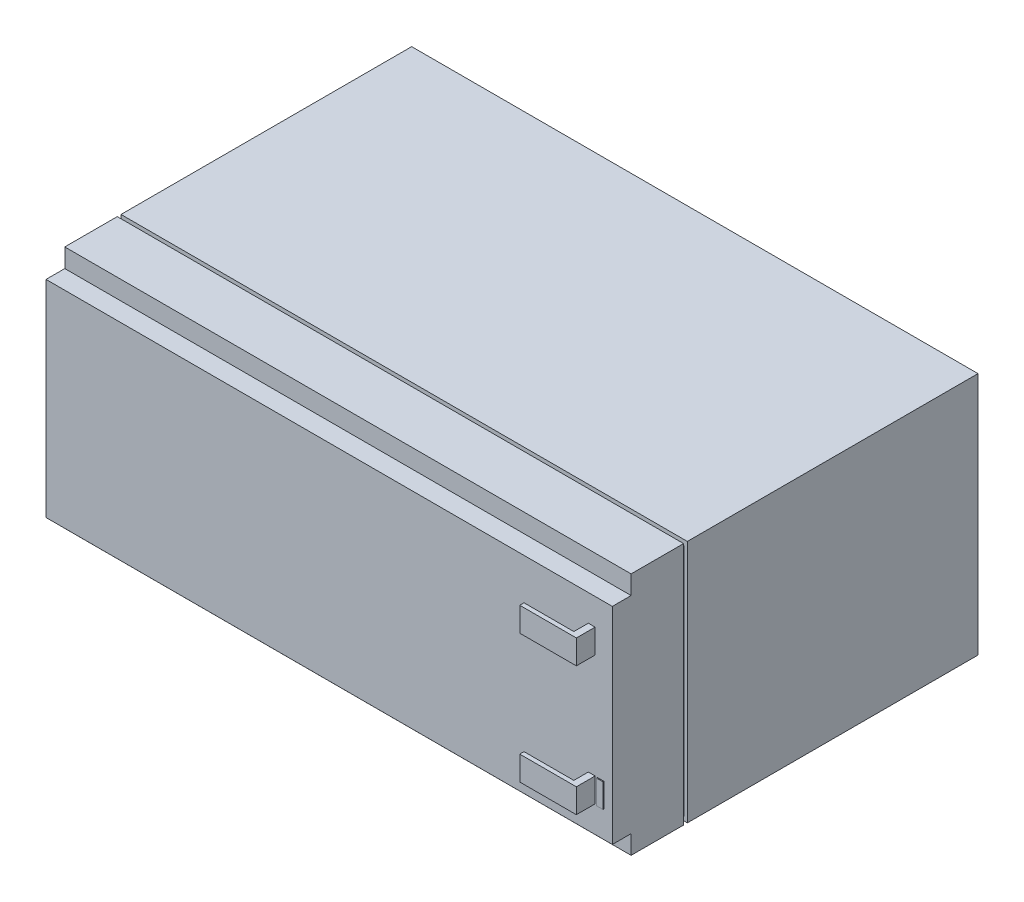
ISO-10303-21;
HEADER;
FILE_DESCRIPTION(('STEP AP214'),'2;1');
FILE_NAME('part.step','',(''),(''),'','','');
FILE_SCHEMA(('AUTOMOTIVE_DESIGN { 1 0 10303 214 1 1 1 1 }'));
ENDSEC;
DATA;
#1=APPLICATION_CONTEXT('core data for automotive mechanical design processes');
#2=APPLICATION_PROTOCOL_DEFINITION('international standard','automotive_design',2000,#1);
#3=PRODUCT_CONTEXT('',#1,'mechanical');
#4=PRODUCT('Part','Part','',(#3));
#5=PRODUCT_RELATED_PRODUCT_CATEGORY('part','',(#4));
#6=PRODUCT_DEFINITION_FORMATION('','',#4);
#7=PRODUCT_DEFINITION_CONTEXT('part definition',#1,'design');
#8=PRODUCT_DEFINITION('design','',#6,#7);
#9=PRODUCT_DEFINITION_SHAPE('','',#8);
#10=(LENGTH_UNIT() NAMED_UNIT(*) SI_UNIT(.MILLI.,.METRE.));
#11=(NAMED_UNIT(*) PLANE_ANGLE_UNIT() SI_UNIT($,.RADIAN.));
#12=(NAMED_UNIT(*) SI_UNIT($,.STERADIAN.) SOLID_ANGLE_UNIT());
#13=UNCERTAINTY_MEASURE_WITH_UNIT(LENGTH_MEASURE(1.E-05),#10,'distance_accuracy_value','');
#14=(GEOMETRIC_REPRESENTATION_CONTEXT(3) GLOBAL_UNCERTAINTY_ASSIGNED_CONTEXT((#13)) GLOBAL_UNIT_ASSIGNED_CONTEXT((#10,
#11,#12)) REPRESENTATION_CONTEXT('',''));
#15=CARTESIAN_POINT('',(0.,0.,0.));
#16=DIRECTION('',(0.,0.,1.));
#17=DIRECTION('',(1.,0.,0.));
#18=AXIS2_PLACEMENT_3D('',#15,#16,#17);
#19=CARTESIAN_POINT('',(0.,0.,97.5));
#20=DIRECTION('',(0.,0.,1.));
#21=DIRECTION('',(1.,0.,0.));
#22=AXIS2_PLACEMENT_3D('',#19,#20,#21);
#23=PLANE('',#22);
#24=DIRECTION('',(1.,0.,0.));
#25=VECTOR('',#24,1.);
#26=CARTESIAN_POINT('',(146.408985449097,12.0994469670503,97.5));
#27=LINE('',#26,#25);
#28=CARTESIAN_POINT('',(144.598203584281,12.0994469670503,97.5));
#29=VERTEX_POINT('',#28);
#30=CARTESIAN_POINT('',(146.408985449097,12.0994469670503,97.5));
#31=VERTEX_POINT('',#30);
#32=EDGE_CURVE('E335',#29,#31,#27,.T.);
#33=ORIENTED_EDGE('',*,*,#32,.F.);
#34=DIRECTION('',(0.,1.,0.));
#35=VECTOR('',#34,1.);
#36=CARTESIAN_POINT('',(144.598203584281,7.91395104664027,97.5));
#37=LINE('',#36,#35);
#38=CARTESIAN_POINT('',(144.598203584281,18.5457183715138,97.5));
#39=VERTEX_POINT('',#38);
#40=EDGE_CURVE('E285',#29,#39,#37,.T.);
#41=ORIENTED_EDGE('',*,*,#40,.T.);
#42=DIRECTION('',(-1.,0.,0.));
#43=VECTOR('',#42,1.);
#44=CARTESIAN_POINT('',(146.408985449097,18.5457183715138,97.5));
#45=LINE('',#44,#43);
#46=CARTESIAN_POINT('',(146.408985449097,18.5457183715138,97.5));
#47=VERTEX_POINT('',#46);
#48=EDGE_CURVE('E344',#47,#39,#45,.T.);
#49=ORIENTED_EDGE('',*,*,#48,.F.);
#50=DIRECTION('',(0.,1.,0.));
#51=VECTOR('',#50,1.);
#52=CARTESIAN_POINT('',(146.408985449097,12.0994469670503,97.5));
#53=LINE('',#52,#51);
#54=EDGE_CURVE('E330',#31,#47,#53,.T.);
#55=ORIENTED_EDGE('',*,*,#54,.F.);
#56=EDGE_LOOP('',(#33,#41,#49,#55));
#57=FACE_BOUND('',#56,.T.);
#58=DIRECTION('',(1.,0.,0.));
#59=VECTOR('',#58,1.);
#60=CARTESIAN_POINT('',(146.408985449097,46.4676796421768,97.5));
#61=LINE('',#60,#59);
#62=CARTESIAN_POINT('',(144.598203584281,46.4676796421768,97.5));
#63=VERTEX_POINT('',#62);
#64=CARTESIAN_POINT('',(146.408985449097,46.4676796421768,97.5));
#65=VERTEX_POINT('',#64);
#66=EDGE_CURVE('E307',#63,#65,#61,.T.);
#67=ORIENTED_EDGE('',*,*,#66,.F.);
#68=CARTESIAN_POINT('',(144.598203584281,52.9139510466403,97.5));
#69=VERTEX_POINT('',#68);
#70=EDGE_CURVE('E283',#63,#69,#37,.T.);
#71=ORIENTED_EDGE('',*,*,#70,.T.);
#72=DIRECTION('',(-1.,0.,0.));
#73=VECTOR('',#72,1.);
#74=CARTESIAN_POINT('',(146.408985449097,52.9139510466403,97.5));
#75=LINE('',#74,#73);
#76=CARTESIAN_POINT('',(146.408985449097,52.9139510466403,97.5));
#77=VERTEX_POINT('',#76);
#78=EDGE_CURVE('E316',#77,#69,#75,.T.);
#79=ORIENTED_EDGE('',*,*,#78,.F.);
#80=DIRECTION('',(0.,1.,0.));
#81=VECTOR('',#80,1.);
#82=CARTESIAN_POINT('',(146.408985449097,52.9139510466403,97.5));
#83=LINE('',#82,#81);
#84=EDGE_CURVE('E302',#65,#77,#83,.T.);
#85=ORIENTED_EDGE('',*,*,#84,.F.);
#86=EDGE_LOOP('',(#67,#71,#79,#85));
#87=FACE_BOUND('',#86,.T.);
#88=DIRECTION('',(-1.,0.,0.));
#89=VECTOR('',#88,1.);
#90=CARTESIAN_POINT('',(0.,5.01387264411783,97.5));
#91=LINE('',#90,#89);
#92=CARTESIAN_POINT('',(151.,5.01387264411783,97.5));
#93=VERTEX_POINT('',#92);
#94=CARTESIAN_POINT('',(0.,5.01387264411783,97.5));
#95=VERTEX_POINT('',#94);
#96=EDGE_CURVE('E480',#93,#95,#91,.T.);
#97=ORIENTED_EDGE('',*,*,#96,.F.);
#98=DIRECTION('',(0.,1.,0.));
#99=VECTOR('',#98,1.);
#100=CARTESIAN_POINT('',(151.,0.,97.5));
#101=LINE('',#100,#99);
#102=CARTESIAN_POINT('',(151.,59.9995253695727,97.5));
#103=VERTEX_POINT('',#102);
#104=EDGE_CURVE('E387',#93,#103,#101,.T.);
#105=ORIENTED_EDGE('',*,*,#104,.T.);
#106=DIRECTION('',(1.,0.,0.));
#107=VECTOR('',#106,1.);
#108=CARTESIAN_POINT('',(0.,59.9995253695727,97.5));
#109=LINE('',#108,#107);
#110=CARTESIAN_POINT('',(0.,59.9995253695727,97.5));
#111=VERTEX_POINT('',#110);
#112=EDGE_CURVE('E478',#111,#103,#109,.T.);
#113=ORIENTED_EDGE('',*,*,#112,.F.);
#114=DIRECTION('',(0.,-1.,0.));
#115=VECTOR('',#114,1.);
#116=CARTESIAN_POINT('',(0.,0.,97.5));
#117=LINE('',#116,#115);
#118=EDGE_CURVE('E390',#111,#95,#117,.T.);
#119=ORIENTED_EDGE('',*,*,#118,.T.);
#120=EDGE_LOOP('',(#97,#105,#113,#119));
#121=FACE_BOUND('',#120,.T.);
#122=DIRECTION('',(1.,0.,0.));
#123=VECTOR('',#122,1.);
#124=CARTESIAN_POINT('',(146.99829576239,12.0994469670503,97.5));
#125=LINE('',#124,#123);
#126=CARTESIAN_POINT('',(146.99829576239,12.0994469670503,97.5));
#127=VERTEX_POINT('',#126);
#128=CARTESIAN_POINT('',(148.774724290738,12.0994469670503,97.5));
#129=VERTEX_POINT('',#128);
#130=EDGE_CURVE('E890',#127,#129,#125,.T.);
#131=ORIENTED_EDGE('',*,*,#130,.F.);
#132=DIRECTION('',(0.,-1.,0.));
#133=VECTOR('',#132,1.);
#134=CARTESIAN_POINT('',(146.99829576239,12.0994469670503,97.5));
#135=LINE('',#134,#133);
#136=CARTESIAN_POINT('',(146.99829576239,18.4992112978787,97.5));
#137=VERTEX_POINT('',#136);
#138=EDGE_CURVE('E270',#137,#127,#135,.T.);
#139=ORIENTED_EDGE('',*,*,#138,.F.);
#140=DIRECTION('',(-1.,0.,0.));
#141=VECTOR('',#140,1.);
#142=CARTESIAN_POINT('',(146.99829576239,18.4992112978787,97.5));
#143=LINE('',#142,#141);
#144=CARTESIAN_POINT('',(148.774724290738,18.4992112978787,97.5));
#145=VERTEX_POINT('',#144);
#146=EDGE_CURVE('E266',#145,#137,#143,.T.);
#147=ORIENTED_EDGE('',*,*,#146,.F.);
#148=DIRECTION('',(0.,1.,0.));
#149=VECTOR('',#148,1.);
#150=CARTESIAN_POINT('',(148.774724290738,12.0994469670503,97.5));
#151=LINE('',#150,#149);
#152=EDGE_CURVE('E887',#129,#145,#151,.T.);
#153=ORIENTED_EDGE('',*,*,#152,.F.);
#154=EDGE_LOOP('',(#131,#139,#147,#153));
#155=FACE_BOUND('',#154,.T.);
#156=ADVANCED_FACE('F38',(#57,#87,#121,#155),#23,.T.);
#157=CARTESIAN_POINT('',(0.,0.,77.5));
#158=DIRECTION('',(0.,0.,-1.));
#159=DIRECTION('',(-1.,0.,0.));
#160=AXIS2_PLACEMENT_3D('',#157,#158,#159);
#161=PLANE('',#160);
#162=DIRECTION('',(0.,-1.,0.));
#163=VECTOR('',#162,1.);
#164=CARTESIAN_POINT('',(0.,0.,77.5));
#165=LINE('',#164,#163);
#166=CARTESIAN_POINT('',(0.,65.,77.5));
#167=VERTEX_POINT('',#166);
#168=CARTESIAN_POINT('',(0.,0.,77.5));
#169=VERTEX_POINT('',#168);
#170=EDGE_CURVE('E449',#167,#169,#165,.T.);
#171=ORIENTED_EDGE('',*,*,#170,.T.);
#172=DIRECTION('',(1.,0.,0.));
#173=VECTOR('',#172,1.);
#174=CARTESIAN_POINT('',(0.,0.,77.5));
#175=LINE('',#174,#173);
#176=CARTESIAN_POINT('',(151.,0.,77.5));
#177=VERTEX_POINT('',#176);
#178=EDGE_CURVE('E452',#169,#177,#175,.T.);
#179=ORIENTED_EDGE('',*,*,#178,.T.);
#180=DIRECTION('',(0.,1.,0.));
#181=VECTOR('',#180,1.);
#182=CARTESIAN_POINT('',(151.,0.,77.5));
#183=LINE('',#182,#181);
#184=CARTESIAN_POINT('',(151.,65.,77.5));
#185=VERTEX_POINT('',#184);
#186=EDGE_CURVE('E455',#177,#185,#183,.T.);
#187=ORIENTED_EDGE('',*,*,#186,.T.);
#188=DIRECTION('',(-1.,0.,0.));
#189=VECTOR('',#188,1.);
#190=CARTESIAN_POINT('',(0.,65.,77.5));
#191=LINE('',#190,#189);
#192=EDGE_CURVE('E457',#185,#167,#191,.T.);
#193=ORIENTED_EDGE('',*,*,#192,.T.);
#194=EDGE_LOOP('',(#171,#179,#187,#193));
#195=FACE_BOUND('',#194,.T.);
#196=DIRECTION('',(0.,1.,0.));
#197=VECTOR('',#196,1.);
#198=CARTESIAN_POINT('',(150.049232830441,1.02702784879557,77.5));
#199=LINE('',#198,#197);
#200=CARTESIAN_POINT('',(150.049232830441,1.02702784879557,77.5));
#201=VERTEX_POINT('',#200);
#202=CARTESIAN_POINT('',(150.049232830441,63.6077034191977,77.5));
#203=VERTEX_POINT('',#202);
#204=EDGE_CURVE('E412',#201,#203,#199,.T.);
#205=ORIENTED_EDGE('',*,*,#204,.F.);
#206=DIRECTION('',(1.,0.,0.));
#207=VECTOR('',#206,1.);
#208=CARTESIAN_POINT('',(150.049232830441,1.02702784879557,77.5));
#209=LINE('',#208,#207);
#210=CARTESIAN_POINT('',(1.59432529069087,1.02702784879557,77.5));
#211=VERTEX_POINT('',#210);
#212=EDGE_CURVE('E417',#211,#201,#209,.T.);
#213=ORIENTED_EDGE('',*,*,#212,.F.);
#214=DIRECTION('',(0.,-1.,0.));
#215=VECTOR('',#214,1.);
#216=CARTESIAN_POINT('',(1.59432529069087,1.02702784879557,77.5));
#217=LINE('',#216,#215);
#218=CARTESIAN_POINT('',(1.59432529069087,63.6077034191977,77.5));
#219=VERTEX_POINT('',#218);
#220=EDGE_CURVE('E432',#219,#211,#217,.T.);
#221=ORIENTED_EDGE('',*,*,#220,.F.);
#222=DIRECTION('',(-1.,0.,0.));
#223=VECTOR('',#222,1.);
#224=CARTESIAN_POINT('',(150.049232830441,63.6077034191977,77.5));
#225=LINE('',#224,#223);
#226=EDGE_CURVE('E429',#203,#219,#225,.T.);
#227=ORIENTED_EDGE('',*,*,#226,.F.);
#228=EDGE_LOOP('',(#205,#213,#221,#227));
#229=FACE_BOUND('',#228,.T.);
#230=ADVANCED_FACE('F525',(#195,#229),#161,.F.);
#231=CARTESIAN_POINT('',(0.,0.,77.5));
#232=DIRECTION('',(1.,0.,0.));
#233=DIRECTION('',(0.,0.,-1.));
#234=AXIS2_PLACEMENT_3D('',#231,#232,#233);
#235=PLANE('',#234);
#236=DIRECTION('',(0.,-1.,0.));
#237=VECTOR('',#236,1.);
#238=CARTESIAN_POINT('',(0.,0.,0.));
#239=LINE('',#238,#237);
#240=CARTESIAN_POINT('',(0.,65.,0.));
#241=VERTEX_POINT('',#240);
#242=CARTESIAN_POINT('',(0.,0.,0.));
#243=VERTEX_POINT('',#242);
#244=EDGE_CURVE('E448',#241,#243,#239,.T.);
#245=ORIENTED_EDGE('',*,*,#244,.T.);
#246=DIRECTION('',(0.,0.,-1.));
#247=VECTOR('',#246,1.);
#248=CARTESIAN_POINT('',(0.,0.,77.5));
#249=LINE('',#248,#247);
#250=EDGE_CURVE('E475',#169,#243,#249,.T.);
#251=ORIENTED_EDGE('',*,*,#250,.F.);
#252=ORIENTED_EDGE('',*,*,#170,.F.);
#253=DIRECTION('',(0.,0.,-1.));
#254=VECTOR('',#253,1.);
#255=CARTESIAN_POINT('',(0.,65.,77.5));
#256=LINE('',#255,#254);
#257=EDGE_CURVE('E459',#167,#241,#256,.T.);
#258=ORIENTED_EDGE('',*,*,#257,.T.);
#259=EDGE_LOOP('',(#245,#251,#252,#258));
#260=FACE_BOUND('',#259,.T.);
#261=ADVANCED_FACE('F40',(#260),#235,.F.);
#262=CARTESIAN_POINT('',(0.,0.,77.5));
#263=DIRECTION('',(0.,1.,0.));
#264=DIRECTION('',(0.,0.,1.));
#265=AXIS2_PLACEMENT_3D('',#262,#263,#264);
#266=PLANE('',#265);
#267=DIRECTION('',(1.,0.,0.));
#268=VECTOR('',#267,1.);
#269=CARTESIAN_POINT('',(0.,0.,0.));
#270=LINE('',#269,#268);
#271=CARTESIAN_POINT('',(151.,0.,0.));
#272=VERTEX_POINT('',#271);
#273=EDGE_CURVE('E462',#243,#272,#270,.T.);
#274=ORIENTED_EDGE('',*,*,#273,.T.);
#275=DIRECTION('',(0.,0.,-1.));
#276=VECTOR('',#275,1.);
#277=CARTESIAN_POINT('',(151.,0.,77.5));
#278=LINE('',#277,#276);
#279=EDGE_CURVE('E472',#177,#272,#278,.T.);
#280=ORIENTED_EDGE('',*,*,#279,.F.);
#281=ORIENTED_EDGE('',*,*,#178,.F.);
#282=ORIENTED_EDGE('',*,*,#250,.T.);
#283=EDGE_LOOP('',(#274,#280,#281,#282));
#284=FACE_BOUND('',#283,.T.);
#285=ADVANCED_FACE('F585',(#284),#266,.F.);
#286=CARTESIAN_POINT('',(151.,0.,77.5));
#287=DIRECTION('',(-1.,0.,0.));
#288=DIRECTION('',(0.,0.,1.));
#289=AXIS2_PLACEMENT_3D('',#286,#287,#288);
#290=PLANE('',#289);
#291=DIRECTION('',(0.,1.,0.));
#292=VECTOR('',#291,1.);
#293=CARTESIAN_POINT('',(151.,0.,0.));
#294=LINE('',#293,#292);
#295=CARTESIAN_POINT('',(151.,65.,0.));
#296=VERTEX_POINT('',#295);
#297=EDGE_CURVE('E464',#272,#296,#294,.T.);
#298=ORIENTED_EDGE('',*,*,#297,.T.);
#299=DIRECTION('',(0.,0.,-1.));
#300=VECTOR('',#299,1.);
#301=CARTESIAN_POINT('',(151.,65.,77.5));
#302=LINE('',#301,#300);
#303=EDGE_CURVE('E469',#185,#296,#302,.T.);
#304=ORIENTED_EDGE('',*,*,#303,.F.);
#305=ORIENTED_EDGE('',*,*,#186,.F.);
#306=ORIENTED_EDGE('',*,*,#279,.T.);
#307=EDGE_LOOP('',(#298,#304,#305,#306));
#308=FACE_BOUND('',#307,.T.);
#309=ADVANCED_FACE('F582',(#308),#290,.F.);
#310=CARTESIAN_POINT('',(0.,65.,77.5));
#311=DIRECTION('',(0.,-1.,0.));
#312=DIRECTION('',(0.,0.,-1.));
#313=AXIS2_PLACEMENT_3D('',#310,#311,#312);
#314=PLANE('',#313);
#315=DIRECTION('',(-1.,0.,0.));
#316=VECTOR('',#315,1.);
#317=CARTESIAN_POINT('',(0.,65.,0.));
#318=LINE('',#317,#316);
#319=EDGE_CURVE('E453',#296,#241,#318,.T.);
#320=ORIENTED_EDGE('',*,*,#319,.T.);
#321=ORIENTED_EDGE('',*,*,#257,.F.);
#322=ORIENTED_EDGE('',*,*,#192,.F.);
#323=ORIENTED_EDGE('',*,*,#303,.T.);
#324=EDGE_LOOP('',(#320,#321,#322,#323));
#325=FACE_BOUND('',#324,.T.);
#326=ADVANCED_FACE('F578',(#325),#314,.F.);
#327=CARTESIAN_POINT('',(0.,0.,0.));
#328=DIRECTION('',(0.,0.,-1.));
#329=DIRECTION('',(-1.,0.,0.));
#330=AXIS2_PLACEMENT_3D('',#327,#328,#329);
#331=PLANE('',#330);
#332=ORIENTED_EDGE('',*,*,#244,.F.);
#333=ORIENTED_EDGE('',*,*,#319,.F.);
#334=ORIENTED_EDGE('',*,*,#297,.F.);
#335=ORIENTED_EDGE('',*,*,#273,.F.);
#336=EDGE_LOOP('',(#332,#333,#334,#335));
#337=FACE_BOUND('',#336,.T.);
#338=ADVANCED_FACE('F573',(#337),#331,.T.);
#339=CARTESIAN_POINT('',(150.049232830441,1.02702784879557,78.5));
#340=DIRECTION('',(-1.,0.,0.));
#341=DIRECTION('',(0.,0.,1.));
#342=AXIS2_PLACEMENT_3D('',#339,#340,#341);
#343=PLANE('',#342);
#344=ORIENTED_EDGE('',*,*,#204,.T.);
#345=DIRECTION('',(0.,0.,-1.));
#346=VECTOR('',#345,1.);
#347=CARTESIAN_POINT('',(150.049232830441,63.6077034191977,78.5));
#348=LINE('',#347,#346);
#349=CARTESIAN_POINT('',(150.049232830441,63.6077034191977,78.5));
#350=VERTEX_POINT('',#349);
#351=EDGE_CURVE('E445',#350,#203,#348,.T.);
#352=ORIENTED_EDGE('',*,*,#351,.F.);
#353=DIRECTION('',(0.,1.,0.));
#354=VECTOR('',#353,1.);
#355=CARTESIAN_POINT('',(150.049232830441,1.02702784879557,78.5));
#356=LINE('',#355,#354);
#357=CARTESIAN_POINT('',(150.049232830441,1.02702784879557,78.5));
#358=VERTEX_POINT('',#357);
#359=EDGE_CURVE('E413',#358,#350,#356,.T.);
#360=ORIENTED_EDGE('',*,*,#359,.F.);
#361=DIRECTION('',(0.,0.,-1.));
#362=VECTOR('',#361,1.);
#363=CARTESIAN_POINT('',(150.049232830441,1.02702784879557,78.5));
#364=LINE('',#363,#362);
#365=EDGE_CURVE('E426',#358,#201,#364,.T.);
#366=ORIENTED_EDGE('',*,*,#365,.T.);
#367=EDGE_LOOP('',(#344,#352,#360,#366));
#368=FACE_BOUND('',#367,.T.);
#369=ADVANCED_FACE('F570',(#368),#343,.F.);
#370=CARTESIAN_POINT('',(150.049232830441,63.6077034191977,78.5));
#371=DIRECTION('',(0.,-1.,0.));
#372=DIRECTION('',(0.,0.,-1.));
#373=AXIS2_PLACEMENT_3D('',#370,#371,#372);
#374=PLANE('',#373);
#375=ORIENTED_EDGE('',*,*,#226,.T.);
#376=DIRECTION('',(0.,0.,-1.));
#377=VECTOR('',#376,1.);
#378=CARTESIAN_POINT('',(1.59432529069087,63.6077034191977,78.5));
#379=LINE('',#378,#377);
#380=CARTESIAN_POINT('',(1.59432529069087,63.6077034191977,78.5));
#381=VERTEX_POINT('',#380);
#382=EDGE_CURVE('E442',#381,#219,#379,.T.);
#383=ORIENTED_EDGE('',*,*,#382,.F.);
#384=DIRECTION('',(-1.,0.,0.));
#385=VECTOR('',#384,1.);
#386=CARTESIAN_POINT('',(150.049232830441,63.6077034191977,78.5));
#387=LINE('',#386,#385);
#388=EDGE_CURVE('E416',#350,#381,#387,.T.);
#389=ORIENTED_EDGE('',*,*,#388,.F.);
#390=ORIENTED_EDGE('',*,*,#351,.T.);
#391=EDGE_LOOP('',(#375,#383,#389,#390));
#392=FACE_BOUND('',#391,.T.);
#393=ADVANCED_FACE('F566',(#392),#374,.F.);
#394=CARTESIAN_POINT('',(1.59432529069087,1.02702784879557,78.5));
#395=DIRECTION('',(1.,0.,0.));
#396=DIRECTION('',(0.,0.,-1.));
#397=AXIS2_PLACEMENT_3D('',#394,#395,#396);
#398=PLANE('',#397);
#399=ORIENTED_EDGE('',*,*,#220,.T.);
#400=DIRECTION('',(0.,0.,-1.));
#401=VECTOR('',#400,1.);
#402=CARTESIAN_POINT('',(1.59432529069087,1.02702784879557,78.5));
#403=LINE('',#402,#401);
#404=CARTESIAN_POINT('',(1.59432529069087,1.02702784879557,78.5));
#405=VERTEX_POINT('',#404);
#406=EDGE_CURVE('E439',#405,#211,#403,.T.);
#407=ORIENTED_EDGE('',*,*,#406,.F.);
#408=DIRECTION('',(0.,-1.,0.));
#409=VECTOR('',#408,1.);
#410=CARTESIAN_POINT('',(1.59432529069087,1.02702784879557,78.5));
#411=LINE('',#410,#409);
#412=EDGE_CURVE('E420',#381,#405,#411,.T.);
#413=ORIENTED_EDGE('',*,*,#412,.F.);
#414=ORIENTED_EDGE('',*,*,#382,.T.);
#415=EDGE_LOOP('',(#399,#407,#413,#414));
#416=FACE_BOUND('',#415,.T.);
#417=ADVANCED_FACE('F562',(#416),#398,.F.);
#418=CARTESIAN_POINT('',(150.049232830441,1.02702784879557,78.5));
#419=DIRECTION('',(0.,1.,0.));
#420=DIRECTION('',(0.,0.,1.));
#421=AXIS2_PLACEMENT_3D('',#418,#419,#420);
#422=PLANE('',#421);
#423=ORIENTED_EDGE('',*,*,#212,.T.);
#424=ORIENTED_EDGE('',*,*,#365,.F.);
#425=DIRECTION('',(1.,0.,0.));
#426=VECTOR('',#425,1.);
#427=CARTESIAN_POINT('',(150.049232830441,1.02702784879557,78.5));
#428=LINE('',#427,#426);
#429=EDGE_CURVE('E423',#405,#358,#428,.T.);
#430=ORIENTED_EDGE('',*,*,#429,.F.);
#431=ORIENTED_EDGE('',*,*,#406,.T.);
#432=EDGE_LOOP('',(#423,#424,#430,#431));
#433=FACE_BOUND('',#432,.T.);
#434=ADVANCED_FACE('F542',(#433),#422,.F.);
#435=CARTESIAN_POINT('',(0.,0.,78.5));
#436=DIRECTION('',(0.,0.,1.));
#437=DIRECTION('',(1.,0.,0.));
#438=AXIS2_PLACEMENT_3D('',#435,#436,#437);
#439=PLANE('',#438);
#440=DIRECTION('',(0.,1.,0.));
#441=VECTOR('',#440,1.);
#442=CARTESIAN_POINT('',(151.,0.,78.5));
#443=LINE('',#442,#441);
#444=CARTESIAN_POINT('',(151.,0.,78.5));
#445=VERTEX_POINT('',#444);
#446=CARTESIAN_POINT('',(151.,65.,78.5));
#447=VERTEX_POINT('',#446);
#448=EDGE_CURVE('E386',#445,#447,#443,.T.);
#449=ORIENTED_EDGE('',*,*,#448,.F.);
#450=DIRECTION('',(1.,0.,0.));
#451=VECTOR('',#450,1.);
#452=CARTESIAN_POINT('',(151.,0.,78.5));
#453=LINE('',#452,#451);
#454=CARTESIAN_POINT('',(0.,0.,78.5));
#455=VERTEX_POINT('',#454);
#456=EDGE_CURVE('E391',#455,#445,#453,.T.);
#457=ORIENTED_EDGE('',*,*,#456,.F.);
#458=DIRECTION('',(0.,-1.,0.));
#459=VECTOR('',#458,1.);
#460=CARTESIAN_POINT('',(0.,0.,78.5));
#461=LINE('',#460,#459);
#462=CARTESIAN_POINT('',(0.,65.,78.5));
#463=VERTEX_POINT('',#462);
#464=EDGE_CURVE('E400',#463,#455,#461,.T.);
#465=ORIENTED_EDGE('',*,*,#464,.F.);
#466=DIRECTION('',(-1.,0.,0.));
#467=VECTOR('',#466,1.);
#468=CARTESIAN_POINT('',(151.,65.,78.5));
#469=LINE('',#468,#467);
#470=EDGE_CURVE('E397',#447,#463,#469,.T.);
#471=ORIENTED_EDGE('',*,*,#470,.F.);
#472=EDGE_LOOP('',(#449,#457,#465,#471));
#473=FACE_BOUND('',#472,.T.);
#474=ORIENTED_EDGE('',*,*,#429,.T.);
#475=ORIENTED_EDGE('',*,*,#359,.T.);
#476=ORIENTED_EDGE('',*,*,#388,.T.);
#477=ORIENTED_EDGE('',*,*,#412,.T.);
#478=EDGE_LOOP('',(#474,#475,#476,#477));
#479=FACE_BOUND('',#478,.T.);
#480=ADVANCED_FACE('F538',(#473,#479),#439,.F.);
#481=CARTESIAN_POINT('',(151.,0.,97.5));
#482=DIRECTION('',(-1.,0.,0.));
#483=DIRECTION('',(0.,0.,1.));
#484=AXIS2_PLACEMENT_3D('',#481,#482,#483);
#485=PLANE('',#484);
#486=ORIENTED_EDGE('',*,*,#104,.F.);
#487=DIRECTION('',(0.,0.,1.));
#488=VECTOR('',#487,1.);
#489=CARTESIAN_POINT('',(151.,5.01387264411783,97.5));
#490=LINE('',#489,#488);
#491=CARTESIAN_POINT('',(151.,5.01387264411783,92.495127271096));
#492=VERTEX_POINT('',#491);
#493=EDGE_CURVE('E362',#492,#93,#490,.T.);
#494=ORIENTED_EDGE('',*,*,#493,.F.);
#495=DIRECTION('',(0.,1.,0.));
#496=VECTOR('',#495,1.);
#497=CARTESIAN_POINT('',(151.,0.,92.495127271096));
#498=LINE('',#497,#496);
#499=CARTESIAN_POINT('',(151.,0.,92.495127271096));
#500=VERTEX_POINT('',#499);
#501=EDGE_CURVE('E359',#500,#492,#498,.T.);
#502=ORIENTED_EDGE('',*,*,#501,.F.);
#503=DIRECTION('',(0.,0.,-1.));
#504=VECTOR('',#503,1.);
#505=CARTESIAN_POINT('',(151.,0.,97.5));
#506=LINE('',#505,#504);
#507=EDGE_CURVE('E394',#500,#445,#506,.T.);
#508=ORIENTED_EDGE('',*,*,#507,.T.);
#509=ORIENTED_EDGE('',*,*,#448,.T.);
#510=DIRECTION('',(0.,0.,-1.));
#511=VECTOR('',#510,1.);
#512=CARTESIAN_POINT('',(151.,65.,97.5));
#513=LINE('',#512,#511);
#514=CARTESIAN_POINT('',(151.,65.,92.495127271096));
#515=VERTEX_POINT('',#514);
#516=EDGE_CURVE('E410',#515,#447,#513,.T.);
#517=ORIENTED_EDGE('',*,*,#516,.F.);
#518=DIRECTION('',(0.,1.,0.));
#519=VECTOR('',#518,1.);
#520=CARTESIAN_POINT('',(151.,65.,92.495127271096));
#521=LINE('',#520,#519);
#522=CARTESIAN_POINT('',(151.,59.9995253695727,92.495127271096));
#523=VERTEX_POINT('',#522);
#524=EDGE_CURVE('E372',#523,#515,#521,.T.);
#525=ORIENTED_EDGE('',*,*,#524,.F.);
#526=DIRECTION('',(0.,0.,-1.));
#527=VECTOR('',#526,1.);
#528=CARTESIAN_POINT('',(151.,59.9995253695727,97.5));
#529=LINE('',#528,#527);
#530=EDGE_CURVE('E358',#103,#523,#529,.T.);
#531=ORIENTED_EDGE('',*,*,#530,.F.);
#532=EDGE_LOOP('',(#486,#494,#502,#508,#509,#517,#525,#531));
#533=FACE_BOUND('',#532,.T.);
#534=ADVANCED_FACE('F541',(#533),#485,.F.);
#535=CARTESIAN_POINT('',(151.,65.,97.5));
#536=DIRECTION('',(0.,-1.,0.));
#537=DIRECTION('',(0.,0.,-1.));
#538=AXIS2_PLACEMENT_3D('',#535,#536,#537);
#539=PLANE('',#538);
#540=DIRECTION('',(0.,0.,-1.));
#541=VECTOR('',#540,1.);
#542=CARTESIAN_POINT('',(0.,65.,97.5));
#543=LINE('',#542,#541);
#544=CARTESIAN_POINT('',(0.,65.,92.495127271096));
#545=VERTEX_POINT('',#544);
#546=EDGE_CURVE('E408',#545,#463,#543,.T.);
#547=ORIENTED_EDGE('',*,*,#546,.F.);
#548=DIRECTION('',(1.,0.,0.));
#549=VECTOR('',#548,1.);
#550=CARTESIAN_POINT('',(-8.00000000000001,65.,92.495127271096));
#551=LINE('',#550,#549);
#552=EDGE_CURVE('E363',#545,#515,#551,.T.);
#553=ORIENTED_EDGE('',*,*,#552,.T.);
#554=ORIENTED_EDGE('',*,*,#516,.T.);
#555=ORIENTED_EDGE('',*,*,#470,.T.);
#556=EDGE_LOOP('',(#547,#553,#554,#555));
#557=FACE_BOUND('',#556,.T.);
#558=ADVANCED_FACE('F552',(#557),#539,.F.);
#559=CARTESIAN_POINT('',(0.,0.,97.5));
#560=DIRECTION('',(1.,0.,0.));
#561=DIRECTION('',(0.,0.,-1.));
#562=AXIS2_PLACEMENT_3D('',#559,#560,#561);
#563=PLANE('',#562);
#564=DIRECTION('',(0.,1.,0.));
#565=VECTOR('',#564,1.);
#566=CARTESIAN_POINT('',(0.,0.,92.495127271096));
#567=LINE('',#566,#565);
#568=CARTESIAN_POINT('',(0.,0.,92.495127271096));
#569=VERTEX_POINT('',#568);
#570=CARTESIAN_POINT('',(0.,5.01387264411783,92.495127271096));
#571=VERTEX_POINT('',#570);
#572=EDGE_CURVE('E383',#569,#571,#567,.T.);
#573=ORIENTED_EDGE('',*,*,#572,.T.);
#574=DIRECTION('',(0.,0.,1.));
#575=VECTOR('',#574,1.);
#576=CARTESIAN_POINT('',(0.,5.01387264411783,97.5));
#577=LINE('',#576,#575);
#578=EDGE_CURVE('E380',#571,#95,#577,.T.);
#579=ORIENTED_EDGE('',*,*,#578,.T.);
#580=ORIENTED_EDGE('',*,*,#118,.F.);
#581=DIRECTION('',(0.,0.,-1.));
#582=VECTOR('',#581,1.);
#583=CARTESIAN_POINT('',(0.,59.9995253695727,97.5));
#584=LINE('',#583,#582);
#585=CARTESIAN_POINT('',(0.,59.9995253695727,92.495127271096));
#586=VERTEX_POINT('',#585);
#587=EDGE_CURVE('E368',#111,#586,#584,.T.);
#588=ORIENTED_EDGE('',*,*,#587,.T.);
#589=DIRECTION('',(0.,1.,0.));
#590=VECTOR('',#589,1.);
#591=CARTESIAN_POINT('',(0.,0.,92.495127271096));
#592=LINE('',#591,#590);
#593=EDGE_CURVE('E482',#586,#545,#592,.T.);
#594=ORIENTED_EDGE('',*,*,#593,.T.);
#595=ORIENTED_EDGE('',*,*,#546,.T.);
#596=ORIENTED_EDGE('',*,*,#464,.T.);
#597=DIRECTION('',(0.,0.,-1.));
#598=VECTOR('',#597,1.);
#599=CARTESIAN_POINT('',(0.,0.,97.5));
#600=LINE('',#599,#598);
#601=EDGE_CURVE('E406',#569,#455,#600,.T.);
#602=ORIENTED_EDGE('',*,*,#601,.F.);
#603=EDGE_LOOP('',(#573,#579,#580,#588,#594,#595,#596,#602));
#604=FACE_BOUND('',#603,.T.);
#605=ADVANCED_FACE('F548',(#604),#563,.F.);
#606=CARTESIAN_POINT('',(151.,0.,97.5));
#607=DIRECTION('',(0.,1.,0.));
#608=DIRECTION('',(0.,0.,1.));
#609=AXIS2_PLACEMENT_3D('',#606,#607,#608);
#610=PLANE('',#609);
#611=ORIENTED_EDGE('',*,*,#507,.F.);
#612=DIRECTION('',(1.,0.,0.));
#613=VECTOR('',#612,1.);
#614=CARTESIAN_POINT('',(-8.00000000000001,0.,92.495127271096));
#615=LINE('',#614,#613);
#616=EDGE_CURVE('E365',#569,#500,#615,.T.);
#617=ORIENTED_EDGE('',*,*,#616,.F.);
#618=ORIENTED_EDGE('',*,*,#601,.T.);
#619=ORIENTED_EDGE('',*,*,#456,.T.);
#620=EDGE_LOOP('',(#611,#617,#618,#619));
#621=FACE_BOUND('',#620,.T.);
#622=ADVANCED_FACE('F544',(#621),#610,.F.);
#623=CARTESIAN_POINT('',(-8.00000000000001,65.,92.495127271096));
#624=DIRECTION('',(0.,0.,-1.));
#625=DIRECTION('',(-1.,0.,0.));
#626=AXIS2_PLACEMENT_3D('',#623,#624,#625);
#627=PLANE('',#626);
#628=DIRECTION('',(1.,0.,0.));
#629=VECTOR('',#628,1.);
#630=CARTESIAN_POINT('',(-8.00000000000001,59.9995253695727,92.495127271096));
#631=LINE('',#630,#629);
#632=EDGE_CURVE('E374',#586,#523,#631,.T.);
#633=ORIENTED_EDGE('',*,*,#632,.T.);
#634=ORIENTED_EDGE('',*,*,#524,.T.);
#635=ORIENTED_EDGE('',*,*,#552,.F.);
#636=ORIENTED_EDGE('',*,*,#593,.F.);
#637=EDGE_LOOP('',(#633,#634,#635,#636));
#638=FACE_BOUND('',#637,.T.);
#639=ADVANCED_FACE('F547',(#638),#627,.F.);
#640=CARTESIAN_POINT('',(-8.00000000000001,59.9995253695727,97.5));
#641=DIRECTION('',(0.,-1.,0.));
#642=DIRECTION('',(0.,0.,-1.));
#643=AXIS2_PLACEMENT_3D('',#640,#641,#642);
#644=PLANE('',#643);
#645=ORIENTED_EDGE('',*,*,#112,.T.);
#646=ORIENTED_EDGE('',*,*,#530,.T.);
#647=ORIENTED_EDGE('',*,*,#632,.F.);
#648=ORIENTED_EDGE('',*,*,#587,.F.);
#649=EDGE_LOOP('',(#645,#646,#647,#648));
#650=FACE_BOUND('',#649,.T.);
#651=ADVANCED_FACE('F536',(#650),#644,.F.);
#652=CARTESIAN_POINT('',(-8.00000000000001,0.,92.495127271096));
#653=DIRECTION('',(0.,0.,-1.));
#654=DIRECTION('',(-1.,0.,0.));
#655=AXIS2_PLACEMENT_3D('',#652,#653,#654);
#656=PLANE('',#655);
#657=ORIENTED_EDGE('',*,*,#616,.T.);
#658=ORIENTED_EDGE('',*,*,#501,.T.);
#659=DIRECTION('',(1.,0.,0.));
#660=VECTOR('',#659,1.);
#661=CARTESIAN_POINT('',(-8.00000000000001,5.01387264411783,92.495127271096));
#662=LINE('',#661,#660);
#663=EDGE_CURVE('E366',#571,#492,#662,.T.);
#664=ORIENTED_EDGE('',*,*,#663,.F.);
#665=ORIENTED_EDGE('',*,*,#572,.F.);
#666=EDGE_LOOP('',(#657,#658,#664,#665));
#667=FACE_BOUND('',#666,.T.);
#668=ADVANCED_FACE('F668',(#667),#656,.F.);
#669=CARTESIAN_POINT('',(-8.00000000000001,5.01387264411783,97.5));
#670=DIRECTION('',(0.,1.,0.));
#671=DIRECTION('',(0.,0.,1.));
#672=AXIS2_PLACEMENT_3D('',#669,#670,#671);
#673=PLANE('',#672);
#674=ORIENTED_EDGE('',*,*,#663,.T.);
#675=ORIENTED_EDGE('',*,*,#493,.T.);
#676=ORIENTED_EDGE('',*,*,#96,.T.);
#677=ORIENTED_EDGE('',*,*,#578,.F.);
#678=EDGE_LOOP('',(#674,#675,#676,#677));
#679=FACE_BOUND('',#678,.T.);
#680=ADVANCED_FACE('F677',(#679),#673,.F.);
#681=CARTESIAN_POINT('',(146.408985449097,12.0994469670503,102.5));
#682=DIRECTION('',(-1.,0.,0.));
#683=DIRECTION('',(0.,0.,1.));
#684=AXIS2_PLACEMENT_3D('',#681,#682,#683);
#685=PLANE('',#684);
#686=ORIENTED_EDGE('',*,*,#54,.T.);
#687=DIRECTION('',(0.,0.,-1.));
#688=VECTOR('',#687,1.);
#689=CARTESIAN_POINT('',(146.408985449097,18.5457183715138,102.5));
#690=LINE('',#689,#688);
#691=CARTESIAN_POINT('',(146.408985449097,18.5457183715138,102.5));
#692=VERTEX_POINT('',#691);
#693=EDGE_CURVE('E356',#692,#47,#690,.T.);
#694=ORIENTED_EDGE('',*,*,#693,.F.);
#695=DIRECTION('',(0.,1.,0.));
#696=VECTOR('',#695,1.);
#697=CARTESIAN_POINT('',(146.408985449097,12.0994469670503,102.5));
#698=LINE('',#697,#696);
#699=CARTESIAN_POINT('',(146.408985449097,12.0994469670503,102.5));
#700=VERTEX_POINT('',#699);
#701=EDGE_CURVE('E331',#700,#692,#698,.T.);
#702=ORIENTED_EDGE('',*,*,#701,.F.);
#703=DIRECTION('',(0.,0.,-1.));
#704=VECTOR('',#703,1.);
#705=CARTESIAN_POINT('',(146.408985449097,12.0994469670503,102.5));
#706=LINE('',#705,#704);
#707=EDGE_CURVE('E341',#700,#31,#706,.T.);
#708=ORIENTED_EDGE('',*,*,#707,.T.);
#709=EDGE_LOOP('',(#686,#694,#702,#708));
#710=FACE_BOUND('',#709,.T.);
#711=ADVANCED_FACE('F686',(#710),#685,.F.);
#712=CARTESIAN_POINT('',(146.408985449097,18.5457183715138,102.5));
#713=DIRECTION('',(0.,-1.,0.));
#714=DIRECTION('',(0.,0.,-1.));
#715=AXIS2_PLACEMENT_3D('',#712,#713,#714);
#716=PLANE('',#715);
#717=ORIENTED_EDGE('',*,*,#48,.T.);
#718=DIRECTION('',(0.,0.,1.));
#719=VECTOR('',#718,1.);
#720=CARTESIAN_POINT('',(144.598203584281,18.5457183715138,102.5));
#721=LINE('',#720,#719);
#722=CARTESIAN_POINT('',(144.598203584281,18.5457183715138,101.36093967735));
#723=VERTEX_POINT('',#722);
#724=EDGE_CURVE('E299',#39,#723,#721,.T.);
#725=ORIENTED_EDGE('',*,*,#724,.T.);
#726=DIRECTION('',(-1.,0.,0.));
#727=VECTOR('',#726,1.);
#728=CARTESIAN_POINT('',(146.408985449097,18.5457183715138,101.36093967735));
#729=LINE('',#728,#727);
#730=CARTESIAN_POINT('',(131.317126513942,18.5457183715138,101.36093967735));
#731=VERTEX_POINT('',#730);
#732=EDGE_CURVE('E293',#723,#731,#729,.T.);
#733=ORIENTED_EDGE('',*,*,#732,.T.);
#734=DIRECTION('',(0.,0.,-1.));
#735=VECTOR('',#734,1.);
#736=CARTESIAN_POINT('',(131.317126513942,18.5457183715138,102.5));
#737=LINE('',#736,#735);
#738=CARTESIAN_POINT('',(131.317126513942,18.5457183715138,102.5));
#739=VERTEX_POINT('',#738);
#740=EDGE_CURVE('E353',#739,#731,#737,.T.);
#741=ORIENTED_EDGE('',*,*,#740,.F.);
#742=DIRECTION('',(-1.,0.,0.));
#743=VECTOR('',#742,1.);
#744=CARTESIAN_POINT('',(146.408985449097,18.5457183715138,102.5));
#745=LINE('',#744,#743);
#746=EDGE_CURVE('E334',#692,#739,#745,.T.);
#747=ORIENTED_EDGE('',*,*,#746,.F.);
#748=ORIENTED_EDGE('',*,*,#693,.T.);
#749=EDGE_LOOP('',(#717,#725,#733,#741,#747,#748));
#750=FACE_BOUND('',#749,.T.);
#751=ADVANCED_FACE('F838',(#750),#716,.F.);
#752=CARTESIAN_POINT('',(131.317126513942,12.0994469670503,102.5));
#753=DIRECTION('',(1.,0.,0.));
#754=DIRECTION('',(0.,0.,-1.));
#755=AXIS2_PLACEMENT_3D('',#752,#753,#754);
#756=PLANE('',#755);
#757=ORIENTED_EDGE('',*,*,#740,.T.);
#758=DIRECTION('',(0.,1.,0.));
#759=VECTOR('',#758,1.);
#760=CARTESIAN_POINT('',(131.317126513942,7.91395104664027,101.36093967735));
#761=LINE('',#760,#759);
#762=CARTESIAN_POINT('',(131.317126513942,12.0994469670503,101.36093967735));
#763=VERTEX_POINT('',#762);
#764=EDGE_CURVE('E288',#763,#731,#761,.T.);
#765=ORIENTED_EDGE('',*,*,#764,.F.);
#766=DIRECTION('',(0.,0.,-1.));
#767=VECTOR('',#766,1.);
#768=CARTESIAN_POINT('',(131.317126513942,12.0994469670503,102.5));
#769=LINE('',#768,#767);
#770=CARTESIAN_POINT('',(131.317126513942,12.0994469670503,102.5));
#771=VERTEX_POINT('',#770);
#772=EDGE_CURVE('E350',#771,#763,#769,.T.);
#773=ORIENTED_EDGE('',*,*,#772,.F.);
#774=DIRECTION('',(0.,-1.,0.));
#775=VECTOR('',#774,1.);
#776=CARTESIAN_POINT('',(131.317126513942,12.0994469670503,102.5));
#777=LINE('',#776,#775);
#778=EDGE_CURVE('E337',#739,#771,#777,.T.);
#779=ORIENTED_EDGE('',*,*,#778,.F.);
#780=EDGE_LOOP('',(#757,#765,#773,#779));
#781=FACE_BOUND('',#780,.T.);
#782=ADVANCED_FACE('F829',(#781),#756,.F.);
#783=CARTESIAN_POINT('',(146.408985449097,12.0994469670503,102.5));
#784=DIRECTION('',(0.,1.,0.));
#785=DIRECTION('',(0.,0.,1.));
#786=AXIS2_PLACEMENT_3D('',#783,#784,#785);
#787=PLANE('',#786);
#788=DIRECTION('',(1.,0.,0.));
#789=VECTOR('',#788,1.);
#790=CARTESIAN_POINT('',(146.408985449097,12.0994469670503,101.36093967735));
#791=LINE('',#790,#789);
#792=CARTESIAN_POINT('',(144.598203584281,12.0994469670503,101.36093967735));
#793=VERTEX_POINT('',#792);
#794=EDGE_CURVE('E290',#763,#793,#791,.T.);
#795=ORIENTED_EDGE('',*,*,#794,.T.);
#796=DIRECTION('',(0.,0.,-1.));
#797=VECTOR('',#796,1.);
#798=CARTESIAN_POINT('',(144.598203584281,12.0994469670503,102.5));
#799=LINE('',#798,#797);
#800=EDGE_CURVE('E296',#793,#29,#799,.T.);
#801=ORIENTED_EDGE('',*,*,#800,.T.);
#802=ORIENTED_EDGE('',*,*,#32,.T.);
#803=ORIENTED_EDGE('',*,*,#707,.F.);
#804=DIRECTION('',(1.,0.,0.));
#805=VECTOR('',#804,1.);
#806=CARTESIAN_POINT('',(146.408985449097,12.0994469670503,102.5));
#807=LINE('',#806,#805);
#808=EDGE_CURVE('E339',#771,#700,#807,.T.);
#809=ORIENTED_EDGE('',*,*,#808,.F.);
#810=ORIENTED_EDGE('',*,*,#772,.T.);
#811=EDGE_LOOP('',(#795,#801,#802,#803,#809,#810));
#812=FACE_BOUND('',#811,.T.);
#813=ADVANCED_FACE('F821',(#812),#787,.F.);
#814=CARTESIAN_POINT('',(0.,0.,102.5));
#815=DIRECTION('',(0.,0.,1.));
#816=DIRECTION('',(1.,0.,0.));
#817=AXIS2_PLACEMENT_3D('',#814,#815,#816);
#818=PLANE('',#817);
#819=ORIENTED_EDGE('',*,*,#701,.T.);
#820=ORIENTED_EDGE('',*,*,#746,.T.);
#821=ORIENTED_EDGE('',*,*,#778,.T.);
#822=ORIENTED_EDGE('',*,*,#808,.T.);
#823=EDGE_LOOP('',(#819,#820,#821,#822));
#824=FACE_BOUND('',#823,.T.);
#825=ADVANCED_FACE('F813',(#824),#818,.T.);
#826=CARTESIAN_POINT('',(146.408985449097,52.9139510466403,102.5));
#827=DIRECTION('',(-1.,0.,0.));
#828=DIRECTION('',(0.,0.,1.));
#829=AXIS2_PLACEMENT_3D('',#826,#827,#828);
#830=PLANE('',#829);
#831=ORIENTED_EDGE('',*,*,#84,.T.);
#832=DIRECTION('',(0.,0.,-1.));
#833=VECTOR('',#832,1.);
#834=CARTESIAN_POINT('',(146.408985449097,52.9139510466403,102.5));
#835=LINE('',#834,#833);
#836=CARTESIAN_POINT('',(146.408985449097,52.9139510466403,102.5));
#837=VERTEX_POINT('',#836);
#838=EDGE_CURVE('E328',#837,#77,#835,.T.);
#839=ORIENTED_EDGE('',*,*,#838,.F.);
#840=DIRECTION('',(0.,1.,0.));
#841=VECTOR('',#840,1.);
#842=CARTESIAN_POINT('',(146.408985449097,52.9139510466403,102.5));
#843=LINE('',#842,#841);
#844=CARTESIAN_POINT('',(146.408985449097,46.4676796421768,102.5));
#845=VERTEX_POINT('',#844);
#846=EDGE_CURVE('E303',#845,#837,#843,.T.);
#847=ORIENTED_EDGE('',*,*,#846,.F.);
#848=DIRECTION('',(0.,0.,-1.));
#849=VECTOR('',#848,1.);
#850=CARTESIAN_POINT('',(146.408985449097,46.4676796421768,102.5));
#851=LINE('',#850,#849);
#852=EDGE_CURVE('E313',#845,#65,#851,.T.);
#853=ORIENTED_EDGE('',*,*,#852,.T.);
#854=EDGE_LOOP('',(#831,#839,#847,#853));
#855=FACE_BOUND('',#854,.T.);
#856=ADVANCED_FACE('F511',(#855),#830,.F.);
#857=CARTESIAN_POINT('',(146.408985449097,52.9139510466403,102.5));
#858=DIRECTION('',(0.,-1.,0.));
#859=DIRECTION('',(0.,0.,-1.));
#860=AXIS2_PLACEMENT_3D('',#857,#858,#859);
#861=PLANE('',#860);
#862=ORIENTED_EDGE('',*,*,#78,.T.);
#863=DIRECTION('',(0.,0.,-1.));
#864=VECTOR('',#863,1.);
#865=CARTESIAN_POINT('',(144.598203584281,52.9139510466403,101.36093967735));
#866=LINE('',#865,#864);
#867=CARTESIAN_POINT('',(144.598203584281,52.9139510466403,101.36093967735));
#868=VERTEX_POINT('',#867);
#869=EDGE_CURVE('E275',#868,#69,#866,.T.);
#870=ORIENTED_EDGE('',*,*,#869,.F.);
#871=DIRECTION('',(1.,0.,0.));
#872=VECTOR('',#871,1.);
#873=CARTESIAN_POINT('',(131.317126513942,52.9139510466403,101.36093967735));
#874=LINE('',#873,#872);
#875=CARTESIAN_POINT('',(131.317126513942,52.9139510466403,101.36093967735));
#876=VERTEX_POINT('',#875);
#877=EDGE_CURVE('E272',#876,#868,#874,.T.);
#878=ORIENTED_EDGE('',*,*,#877,.F.);
#879=DIRECTION('',(0.,0.,-1.));
#880=VECTOR('',#879,1.);
#881=CARTESIAN_POINT('',(131.317126513942,52.9139510466403,102.5));
#882=LINE('',#881,#880);
#883=CARTESIAN_POINT('',(131.317126513942,52.9139510466403,102.5));
#884=VERTEX_POINT('',#883);
#885=EDGE_CURVE('E325',#884,#876,#882,.T.);
#886=ORIENTED_EDGE('',*,*,#885,.F.);
#887=DIRECTION('',(-1.,0.,0.));
#888=VECTOR('',#887,1.);
#889=CARTESIAN_POINT('',(146.408985449097,52.9139510466403,102.5));
#890=LINE('',#889,#888);
#891=EDGE_CURVE('E306',#837,#884,#890,.T.);
#892=ORIENTED_EDGE('',*,*,#891,.F.);
#893=ORIENTED_EDGE('',*,*,#838,.T.);
#894=EDGE_LOOP('',(#862,#870,#878,#886,#892,#893));
#895=FACE_BOUND('',#894,.T.);
#896=ADVANCED_FACE('F500',(#895),#861,.F.);
#897=CARTESIAN_POINT('',(131.317126513942,52.9139510466403,102.5));
#898=DIRECTION('',(1.,0.,0.));
#899=DIRECTION('',(0.,0.,-1.));
#900=AXIS2_PLACEMENT_3D('',#897,#898,#899);
#901=PLANE('',#900);
#902=ORIENTED_EDGE('',*,*,#885,.T.);
#903=CARTESIAN_POINT('',(131.317126513942,46.4676796421768,101.36093967735));
#904=VERTEX_POINT('',#903);
#905=EDGE_CURVE('E282',#904,#876,#761,.T.);
#906=ORIENTED_EDGE('',*,*,#905,.F.);
#907=DIRECTION('',(0.,0.,-1.));
#908=VECTOR('',#907,1.);
#909=CARTESIAN_POINT('',(131.317126513942,46.4676796421768,102.5));
#910=LINE('',#909,#908);
#911=CARTESIAN_POINT('',(131.317126513942,46.4676796421768,102.5));
#912=VERTEX_POINT('',#911);
#913=EDGE_CURVE('E322',#912,#904,#910,.T.);
#914=ORIENTED_EDGE('',*,*,#913,.F.);
#915=DIRECTION('',(0.,-1.,0.));
#916=VECTOR('',#915,1.);
#917=CARTESIAN_POINT('',(131.317126513942,52.9139510466403,102.5));
#918=LINE('',#917,#916);
#919=EDGE_CURVE('E309',#884,#912,#918,.T.);
#920=ORIENTED_EDGE('',*,*,#919,.F.);
#921=EDGE_LOOP('',(#902,#906,#914,#920));
#922=FACE_BOUND('',#921,.T.);
#923=ADVANCED_FACE('F496',(#922),#901,.F.);
#924=CARTESIAN_POINT('',(146.408985449097,46.4676796421768,102.5));
#925=DIRECTION('',(0.,1.,0.));
#926=DIRECTION('',(0.,0.,1.));
#927=AXIS2_PLACEMENT_3D('',#924,#925,#926);
#928=PLANE('',#927);
#929=DIRECTION('',(1.,0.,0.));
#930=VECTOR('',#929,1.);
#931=CARTESIAN_POINT('',(146.408985449097,46.4676796421768,101.36093967735));
#932=LINE('',#931,#930);
#933=CARTESIAN_POINT('',(144.598203584281,46.4676796421768,101.36093967735));
#934=VERTEX_POINT('',#933);
#935=EDGE_CURVE('E46',#904,#934,#932,.T.);
#936=ORIENTED_EDGE('',*,*,#935,.T.);
#937=DIRECTION('',(0.,0.,-1.));
#938=VECTOR('',#937,1.);
#939=CARTESIAN_POINT('',(144.598203584281,46.4676796421768,102.5));
#940=LINE('',#939,#938);
#941=EDGE_CURVE('E11',#934,#63,#940,.T.);
#942=ORIENTED_EDGE('',*,*,#941,.T.);
#943=ORIENTED_EDGE('',*,*,#66,.T.);
#944=ORIENTED_EDGE('',*,*,#852,.F.);
#945=DIRECTION('',(1.,0.,0.));
#946=VECTOR('',#945,1.);
#947=CARTESIAN_POINT('',(146.408985449097,46.4676796421768,102.5));
#948=LINE('',#947,#946);
#949=EDGE_CURVE('E311',#912,#845,#948,.T.);
#950=ORIENTED_EDGE('',*,*,#949,.F.);
#951=ORIENTED_EDGE('',*,*,#913,.T.);
#952=EDGE_LOOP('',(#936,#942,#943,#944,#950,#951));
#953=FACE_BOUND('',#952,.T.);
#954=ADVANCED_FACE('F486',(#953),#928,.F.);
#955=CARTESIAN_POINT('',(0.,0.,102.5));
#956=DIRECTION('',(0.,0.,-1.));
#957=DIRECTION('',(-1.,0.,0.));
#958=AXIS2_PLACEMENT_3D('',#955,#956,#957);
#959=PLANE('',#958);
#960=ORIENTED_EDGE('',*,*,#846,.T.);
#961=ORIENTED_EDGE('',*,*,#891,.T.);
#962=ORIENTED_EDGE('',*,*,#919,.T.);
#963=ORIENTED_EDGE('',*,*,#949,.T.);
#964=EDGE_LOOP('',(#960,#961,#962,#963));
#965=FACE_BOUND('',#964,.T.);
#966=ADVANCED_FACE('F514',(#965),#959,.F.);
#967=CARTESIAN_POINT('',(131.317126513942,7.91395104664027,101.36093967735));
#968=DIRECTION('',(0.,0.,1.));
#969=DIRECTION('',(1.,0.,0.));
#970=AXIS2_PLACEMENT_3D('',#967,#968,#969);
#971=PLANE('',#970);
#972=ORIENTED_EDGE('',*,*,#905,.T.);
#973=ORIENTED_EDGE('',*,*,#877,.T.);
#974=DIRECTION('',(0.,1.,0.));
#975=VECTOR('',#974,1.);
#976=CARTESIAN_POINT('',(144.598203584281,7.91395104664027,101.36093967735));
#977=LINE('',#976,#975);
#978=EDGE_CURVE('E286',#934,#868,#977,.T.);
#979=ORIENTED_EDGE('',*,*,#978,.F.);
#980=ORIENTED_EDGE('',*,*,#935,.F.);
#981=EDGE_LOOP('',(#972,#973,#979,#980));
#982=FACE_BOUND('',#981,.T.);
#983=ADVANCED_FACE('F493',(#982),#971,.F.);
#984=CARTESIAN_POINT('',(144.598203584281,7.91395104664027,101.36093967735));
#985=DIRECTION('',(1.,0.,0.));
#986=DIRECTION('',(0.,0.,-1.));
#987=AXIS2_PLACEMENT_3D('',#984,#985,#986);
#988=PLANE('',#987);
#989=ORIENTED_EDGE('',*,*,#978,.T.);
#990=ORIENTED_EDGE('',*,*,#869,.T.);
#991=ORIENTED_EDGE('',*,*,#70,.F.);
#992=ORIENTED_EDGE('',*,*,#941,.F.);
#993=EDGE_LOOP('',(#989,#990,#991,#992));
#994=FACE_BOUND('',#993,.T.);
#995=ADVANCED_FACE('F504',(#994),#988,.F.);
#996=ORIENTED_EDGE('',*,*,#40,.F.);
#997=ORIENTED_EDGE('',*,*,#800,.F.);
#998=EDGE_CURVE('E61',#793,#723,#977,.T.);
#999=ORIENTED_EDGE('',*,*,#998,.T.);
#1000=ORIENTED_EDGE('',*,*,#724,.F.);
#1001=EDGE_LOOP('',(#996,#997,#999,#1000));
#1002=FACE_BOUND('',#1001,.T.);
#1003=ADVANCED_FACE('F762',(#1002),#988,.F.);
#1004=ORIENTED_EDGE('',*,*,#998,.F.);
#1005=ORIENTED_EDGE('',*,*,#794,.F.);
#1006=ORIENTED_EDGE('',*,*,#764,.T.);
#1007=ORIENTED_EDGE('',*,*,#732,.F.);
#1008=EDGE_LOOP('',(#1004,#1005,#1006,#1007));
#1009=FACE_BOUND('',#1008,.T.);
#1010=ADVANCED_FACE('F522',(#1009),#971,.F.);
#1011=CARTESIAN_POINT('',(146.99829576239,12.0994469670503,97.75));
#1012=DIRECTION('',(1.,0.,0.));
#1013=DIRECTION('',(0.,0.,-1.));
#1014=AXIS2_PLACEMENT_3D('',#1011,#1012,#1013);
#1015=PLANE('',#1014);
#1016=ORIENTED_EDGE('',*,*,#138,.T.);
#1017=DIRECTION('',(0.,0.,-1.));
#1018=VECTOR('',#1017,1.);
#1019=CARTESIAN_POINT('',(146.99829576239,12.0994469670503,97.75));
#1020=LINE('',#1019,#1018);
#1021=CARTESIAN_POINT('',(146.99829576239,12.0994469670503,97.75));
#1022=VERTEX_POINT('',#1021);
#1023=EDGE_CURVE('E251',#1022,#127,#1020,.T.);
#1024=ORIENTED_EDGE('',*,*,#1023,.F.);
#1025=DIRECTION('',(0.,-1.,0.));
#1026=VECTOR('',#1025,1.);
#1027=CARTESIAN_POINT('',(146.99829576239,12.0994469670503,97.75));
#1028=LINE('',#1027,#1026);
#1029=CARTESIAN_POINT('',(146.99829576239,18.4992112978787,97.75));
#1030=VERTEX_POINT('',#1029);
#1031=EDGE_CURVE('E258',#1030,#1022,#1028,.T.);
#1032=ORIENTED_EDGE('',*,*,#1031,.F.);
#1033=DIRECTION('',(0.,0.,-1.));
#1034=VECTOR('',#1033,1.);
#1035=CARTESIAN_POINT('',(146.99829576239,18.4992112978787,97.75));
#1036=LINE('',#1035,#1034);
#1037=EDGE_CURVE('E895',#1030,#137,#1036,.T.);
#1038=ORIENTED_EDGE('',*,*,#1037,.T.);
#1039=EDGE_LOOP('',(#1016,#1024,#1032,#1038));
#1040=FACE_BOUND('',#1039,.T.);
#1041=ADVANCED_FACE('F268',(#1040),#1015,.F.);
#1042=CARTESIAN_POINT('',(146.99829576239,12.0994469670503,97.75));
#1043=DIRECTION('',(0.,1.,0.));
#1044=DIRECTION('',(0.,0.,1.));
#1045=AXIS2_PLACEMENT_3D('',#1042,#1043,#1044);
#1046=PLANE('',#1045);
#1047=ORIENTED_EDGE('',*,*,#130,.T.);
#1048=DIRECTION('',(0.,0.,-1.));
#1049=VECTOR('',#1048,1.);
#1050=CARTESIAN_POINT('',(148.774724290738,12.0994469670503,97.75));
#1051=LINE('',#1050,#1049);
#1052=CARTESIAN_POINT('',(148.774724290738,12.0994469670503,97.75));
#1053=VERTEX_POINT('',#1052);
#1054=EDGE_CURVE('E254',#1053,#129,#1051,.T.);
#1055=ORIENTED_EDGE('',*,*,#1054,.F.);
#1056=DIRECTION('',(1.,0.,0.));
#1057=VECTOR('',#1056,1.);
#1058=CARTESIAN_POINT('',(146.99829576239,12.0994469670503,97.75));
#1059=LINE('',#1058,#1057);
#1060=EDGE_CURVE('E247',#1022,#1053,#1059,.T.);
#1061=ORIENTED_EDGE('',*,*,#1060,.F.);
#1062=ORIENTED_EDGE('',*,*,#1023,.T.);
#1063=EDGE_LOOP('',(#1047,#1055,#1061,#1062));
#1064=FACE_BOUND('',#1063,.T.);
#1065=ADVANCED_FACE('F249',(#1064),#1046,.F.);
#1066=CARTESIAN_POINT('',(148.774724290738,12.0994469670503,97.75));
#1067=DIRECTION('',(-1.,0.,0.));
#1068=DIRECTION('',(0.,0.,1.));
#1069=AXIS2_PLACEMENT_3D('',#1066,#1067,#1068);
#1070=PLANE('',#1069);
#1071=ORIENTED_EDGE('',*,*,#152,.T.);
#1072=DIRECTION('',(0.,0.,-1.));
#1073=VECTOR('',#1072,1.);
#1074=CARTESIAN_POINT('',(148.774724290738,18.4992112978787,97.75));
#1075=LINE('',#1074,#1073);
#1076=CARTESIAN_POINT('',(148.774724290738,18.4992112978787,97.75));
#1077=VERTEX_POINT('',#1076);
#1078=EDGE_CURVE('E53',#1077,#145,#1075,.T.);
#1079=ORIENTED_EDGE('',*,*,#1078,.F.);
#1080=DIRECTION('',(0.,1.,0.));
#1081=VECTOR('',#1080,1.);
#1082=CARTESIAN_POINT('',(148.774724290738,12.0994469670503,97.75));
#1083=LINE('',#1082,#1081);
#1084=EDGE_CURVE('E257',#1053,#1077,#1083,.T.);
#1085=ORIENTED_EDGE('',*,*,#1084,.F.);
#1086=ORIENTED_EDGE('',*,*,#1054,.T.);
#1087=EDGE_LOOP('',(#1071,#1079,#1085,#1086));
#1088=FACE_BOUND('',#1087,.T.);
#1089=ADVANCED_FACE('F713',(#1088),#1070,.F.);
#1090=CARTESIAN_POINT('',(146.99829576239,18.4992112978787,97.75));
#1091=DIRECTION('',(0.,-1.,0.));
#1092=DIRECTION('',(0.,0.,-1.));
#1093=AXIS2_PLACEMENT_3D('',#1090,#1091,#1092);
#1094=PLANE('',#1093);
#1095=ORIENTED_EDGE('',*,*,#146,.T.);
#1096=ORIENTED_EDGE('',*,*,#1037,.F.);
#1097=DIRECTION('',(-1.,0.,0.));
#1098=VECTOR('',#1097,1.);
#1099=CARTESIAN_POINT('',(146.99829576239,18.4992112978787,97.75));
#1100=LINE('',#1099,#1098);
#1101=EDGE_CURVE('E262',#1077,#1030,#1100,.T.);
#1102=ORIENTED_EDGE('',*,*,#1101,.F.);
#1103=ORIENTED_EDGE('',*,*,#1078,.T.);
#1104=EDGE_LOOP('',(#1095,#1096,#1102,#1103));
#1105=FACE_BOUND('',#1104,.T.);
#1106=ADVANCED_FACE('F720',(#1105),#1094,.F.);
#1107=CARTESIAN_POINT('',(0.,0.,97.75));
#1108=DIRECTION('',(0.,0.,-1.));
#1109=DIRECTION('',(-1.,0.,0.));
#1110=AXIS2_PLACEMENT_3D('',#1107,#1108,#1109);
#1111=PLANE('',#1110);
#1112=ORIENTED_EDGE('',*,*,#1031,.T.);
#1113=ORIENTED_EDGE('',*,*,#1060,.T.);
#1114=ORIENTED_EDGE('',*,*,#1084,.T.);
#1115=ORIENTED_EDGE('',*,*,#1101,.T.);
#1116=EDGE_LOOP('',(#1112,#1113,#1114,#1115));
#1117=FACE_BOUND('',#1116,.T.);
#1118=ADVANCED_FACE('F261',(#1117),#1111,.F.);
#1119=CLOSED_SHELL('',(#156,#230,#261,#285,#309,#326,#338,#369,#393,#417,#434,#480,#534,#558,
#605,#622,#639,#651,#668,#680,#711,#751,#782,#813,#825,#856,#896,#923,#954,#966,#983,#995,#1003,
#1010,#1041,#1065,#1089,#1106,#1118));
#1120=MANIFOLD_SOLID_BREP('B2',#1119);
#1121=ADVANCED_BREP_SHAPE_REPRESENTATION('',(#18,#1120),#14);
#1122=SHAPE_DEFINITION_REPRESENTATION(#9,#1121);
ENDSEC;
END-ISO-10303-21;
